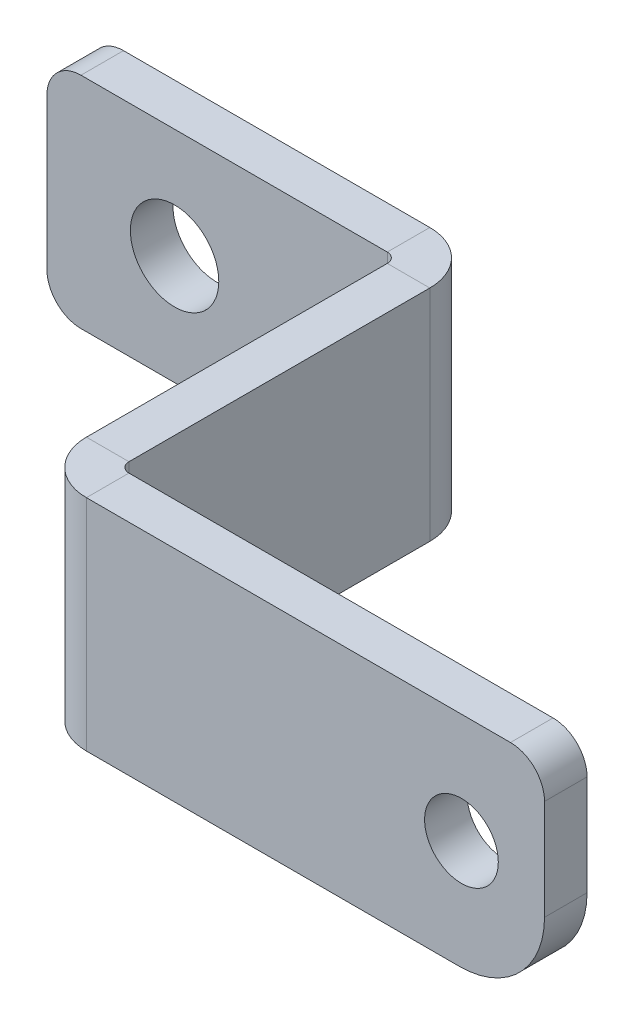
ISO-10303-21;
HEADER;
FILE_DESCRIPTION(('STEP AP214'),'2;1');
FILE_NAME('part.step','',(''),(''),'','','');
FILE_SCHEMA(('AUTOMOTIVE_DESIGN { 1 0 10303 214 1 1 1 1 }'));
ENDSEC;
DATA;
#1=APPLICATION_CONTEXT('core data for automotive mechanical design processes');
#2=APPLICATION_PROTOCOL_DEFINITION('international standard','automotive_design',2000,#1);
#3=PRODUCT_CONTEXT('',#1,'mechanical');
#4=PRODUCT('Part','Part','',(#3));
#5=PRODUCT_RELATED_PRODUCT_CATEGORY('part','',(#4));
#6=PRODUCT_DEFINITION_FORMATION('','',#4);
#7=PRODUCT_DEFINITION_CONTEXT('part definition',#1,'design');
#8=PRODUCT_DEFINITION('design','',#6,#7);
#9=PRODUCT_DEFINITION_SHAPE('','',#8);
#10=(LENGTH_UNIT() NAMED_UNIT(*) SI_UNIT(.MILLI.,.METRE.));
#11=(NAMED_UNIT(*) PLANE_ANGLE_UNIT() SI_UNIT($,.RADIAN.));
#12=(NAMED_UNIT(*) SI_UNIT($,.STERADIAN.) SOLID_ANGLE_UNIT());
#13=UNCERTAINTY_MEASURE_WITH_UNIT(LENGTH_MEASURE(1.E-05),#10,'distance_accuracy_value','');
#14=(GEOMETRIC_REPRESENTATION_CONTEXT(3) GLOBAL_UNCERTAINTY_ASSIGNED_CONTEXT((#13)) GLOBAL_UNIT_ASSIGNED_CONTEXT((#10,
#11,#12)) REPRESENTATION_CONTEXT('',''));
#15=CARTESIAN_POINT('',(0.,0.,0.));
#16=DIRECTION('',(0.,0.,1.));
#17=DIRECTION('',(1.,0.,0.));
#18=AXIS2_PLACEMENT_3D('',#15,#16,#17);
#19=CARTESIAN_POINT('',(65.8241,-45.5626000012021,0.));
#20=DIRECTION('',(0.,1.,0.));
#21=DIRECTION('',(0.,0.,1.));
#22=AXIS2_PLACEMENT_3D('',#19,#20,#21);
#23=PLANE('',#22);
#24=DIRECTION('',(-1.,0.,0.));
#25=VECTOR('',#24,1.);
#26=CARTESIAN_POINT('',(65.8241000000001,-45.5626000012021,23.1902));
#27=LINE('',#26,#25);
#28=CARTESIAN_POINT('',(65.8241000000001,-45.5626000012021,23.1902));
#29=VERTEX_POINT('',#28);
#30=CARTESIAN_POINT('',(62.6491000000001,-45.5626000012021,23.1902));
#31=VERTEX_POINT('',#30);
#32=EDGE_CURVE('E212',#29,#31,#27,.T.);
#33=ORIENTED_EDGE('',*,*,#32,.T.);
#34=DIRECTION('',(0.,0.,1.));
#35=VECTOR('',#34,1.);
#36=CARTESIAN_POINT('',(62.6491,-45.5626000012021,0.));
#37=LINE('',#36,#35);
#38=CARTESIAN_POINT('',(62.6491,-45.562600001202,0.736599999999997));
#39=VERTEX_POINT('',#38);
#40=EDGE_CURVE('E233',#31,#39,#37,.F.);
#41=ORIENTED_EDGE('',*,*,#40,.T.);
#42=DIRECTION('',(-1.,0.,0.));
#43=VECTOR('',#42,1.);
#44=CARTESIAN_POINT('',(65.8241,-45.5626000012021,0.736599999999986));
#45=LINE('',#44,#43);
#46=CARTESIAN_POINT('',(65.8241,-45.562600001202,0.736599999999986));
#47=VERTEX_POINT('',#46);
#48=EDGE_CURVE('E222',#39,#47,#45,.F.);
#49=ORIENTED_EDGE('',*,*,#48,.T.);
#50=DIRECTION('',(0.,0.,-1.));
#51=VECTOR('',#50,1.);
#52=CARTESIAN_POINT('',(65.8241,-45.5626000012021,-2.39758124619434E-13));
#53=LINE('',#52,#51);
#54=EDGE_CURVE('E228',#29,#47,#53,.T.);
#55=ORIENTED_EDGE('',*,*,#54,.F.);
#56=EDGE_LOOP('',(#33,#41,#49,#55));
#57=FACE_BOUND('',#56,.T.);
#58=ADVANCED_FACE('F58',(#57),#23,.F.);
#59=CARTESIAN_POINT('',(65.8241000000001,-29.1846000012021,23.9268));
#60=DIRECTION('',(0.,-1.,0.));
#61=DIRECTION('',(0.,0.,-1.));
#62=AXIS2_PLACEMENT_3D('',#59,#60,#61);
#63=PLANE('',#62);
#64=DIRECTION('',(-1.,0.,0.));
#65=VECTOR('',#64,1.);
#66=CARTESIAN_POINT('',(65.8241000000001,-29.1846000012021,23.1902));
#67=LINE('',#66,#65);
#68=CARTESIAN_POINT('',(65.8241000000001,-29.1846000012021,23.1902));
#69=VERTEX_POINT('',#68);
#70=CARTESIAN_POINT('',(62.6491000000001,-29.1846000012021,23.1902));
#71=VERTEX_POINT('',#70);
#72=EDGE_CURVE('E219',#69,#71,#67,.T.);
#73=ORIENTED_EDGE('',*,*,#72,.F.);
#74=DIRECTION('',(0.,0.,1.));
#75=VECTOR('',#74,1.);
#76=CARTESIAN_POINT('',(65.8241,-29.1846000012021,-2.22312897137587E-13));
#77=LINE('',#76,#75);
#78=CARTESIAN_POINT('',(65.8241,-29.1846000012021,0.736599999999986));
#79=VERTEX_POINT('',#78);
#80=EDGE_CURVE('E224',#79,#69,#77,.T.);
#81=ORIENTED_EDGE('',*,*,#80,.F.);
#82=DIRECTION('',(-1.,0.,0.));
#83=VECTOR('',#82,1.);
#84=CARTESIAN_POINT('',(62.6491,-29.1846000012021,0.736599999999997));
#85=LINE('',#84,#83);
#86=CARTESIAN_POINT('',(62.6491,-29.1846000012021,0.736599999999997));
#87=VERTEX_POINT('',#86);
#88=EDGE_CURVE('E238',#87,#79,#85,.F.);
#89=ORIENTED_EDGE('',*,*,#88,.F.);
#90=DIRECTION('',(0.,0.,-1.));
#91=VECTOR('',#90,1.);
#92=CARTESIAN_POINT('',(62.6491000000001,-29.1846000012021,23.9268));
#93=LINE('',#92,#91);
#94=EDGE_CURVE('E230',#87,#71,#93,.F.);
#95=ORIENTED_EDGE('',*,*,#94,.T.);
#96=EDGE_LOOP('',(#73,#81,#89,#95));
#97=FACE_BOUND('',#96,.T.);
#98=ADVANCED_FACE('F365',(#97),#63,.F.);
#99=CARTESIAN_POINT('',(65.8241,0.,-2.26544738483615E-13));
#100=DIRECTION('',(-1.,0.,0.));
#101=DIRECTION('',(0.,0.,1.));
#102=AXIS2_PLACEMENT_3D('',#99,#100,#101);
#103=PLANE('',#102);
#104=DIRECTION('',(0.,-1.,0.));
#105=VECTOR('',#104,1.);
#106=CARTESIAN_POINT('',(65.8241000000001,-45.5626000012021,23.1902));
#107=LINE('',#106,#105);
#108=EDGE_CURVE('E216',#29,#69,#107,.F.);
#109=ORIENTED_EDGE('',*,*,#108,.F.);
#110=ORIENTED_EDGE('',*,*,#54,.T.);
#111=DIRECTION('',(0.,1.,0.));
#112=VECTOR('',#111,1.);
#113=CARTESIAN_POINT('',(65.8241,-45.5626000012021,0.736599999999986));
#114=LINE('',#113,#112);
#115=EDGE_CURVE('E235',#79,#47,#114,.F.);
#116=ORIENTED_EDGE('',*,*,#115,.F.);
#117=ORIENTED_EDGE('',*,*,#80,.T.);
#118=EDGE_LOOP('',(#109,#110,#116,#117));
#119=FACE_BOUND('',#118,.T.);
#120=ADVANCED_FACE('F371',(#119),#103,.F.);
#121=CARTESIAN_POINT('',(62.6491,0.,-2.15459285232788E-13));
#122=DIRECTION('',(-1.,0.,0.));
#123=DIRECTION('',(0.,0.,1.));
#124=AXIS2_PLACEMENT_3D('',#121,#122,#123);
#125=PLANE('',#124);
#126=ORIENTED_EDGE('',*,*,#40,.F.);
#127=DIRECTION('',(0.,-1.,0.));
#128=VECTOR('',#127,1.);
#129=CARTESIAN_POINT('',(62.6491000000001,-45.5626000012021,23.1902));
#130=LINE('',#129,#128);
#131=EDGE_CURVE('E178',#31,#71,#130,.F.);
#132=ORIENTED_EDGE('',*,*,#131,.T.);
#133=ORIENTED_EDGE('',*,*,#94,.F.);
#134=DIRECTION('',(0.,1.,0.));
#135=VECTOR('',#134,1.);
#136=CARTESIAN_POINT('',(62.6491,-45.5626000012021,0.736599999999997));
#137=LINE('',#136,#135);
#138=EDGE_CURVE('E241',#39,#87,#137,.T.);
#139=ORIENTED_EDGE('',*,*,#138,.F.);
#140=EDGE_LOOP('',(#126,#132,#133,#139));
#141=FACE_BOUND('',#140,.T.);
#142=ADVANCED_FACE('F416',(#141),#125,.T.);
#143=CARTESIAN_POINT('',(36.5125,-29.1846000012021,-3.175));
#144=DIRECTION('',(0.,1.,0.));
#145=DIRECTION('',(0.,0.,1.));
#146=AXIS2_PLACEMENT_3D('',#143,#144,#145);
#147=PLANE('',#146);
#148=DIRECTION('',(-1.,0.,0.));
#149=VECTOR('',#148,1.);
#150=CARTESIAN_POINT('',(36.5125,-29.1846000012021,-3.175));
#151=LINE('',#150,#149);
#152=CARTESIAN_POINT('',(61.9125,-29.1846000012021,-3.175));
#153=VERTEX_POINT('',#152);
#154=CARTESIAN_POINT('',(39.0525,-29.1846000012021,-3.175));
#155=VERTEX_POINT('',#154);
#156=EDGE_CURVE('E263',#153,#155,#151,.T.);
#157=ORIENTED_EDGE('',*,*,#156,.T.);
#158=DIRECTION('',(0.,0.,1.));
#159=VECTOR('',#158,1.);
#160=CARTESIAN_POINT('',(39.0525,-29.1846000012021,-3.175));
#161=LINE('',#160,#159);
#162=CARTESIAN_POINT('',(39.0525,-29.1846000012021,0.));
#163=VERTEX_POINT('',#162);
#164=EDGE_CURVE('E310',#155,#163,#161,.T.);
#165=ORIENTED_EDGE('',*,*,#164,.T.);
#166=DIRECTION('',(-1.,0.,0.));
#167=VECTOR('',#166,1.);
#168=CARTESIAN_POINT('',(36.5125,-29.1846000012021,0.));
#169=LINE('',#168,#167);
#170=CARTESIAN_POINT('',(61.9125,-29.1846000012021,0.));
#171=VERTEX_POINT('',#170);
#172=EDGE_CURVE('E262',#171,#163,#169,.T.);
#173=ORIENTED_EDGE('',*,*,#172,.F.);
#174=DIRECTION('',(0.,0.,1.));
#175=VECTOR('',#174,1.);
#176=CARTESIAN_POINT('',(61.9125,-29.1846000012021,-3.175));
#177=LINE('',#176,#175);
#178=EDGE_CURVE('E285',#153,#171,#177,.T.);
#179=ORIENTED_EDGE('',*,*,#178,.F.);
#180=EDGE_LOOP('',(#157,#165,#173,#179));
#181=FACE_BOUND('',#180,.T.);
#182=ADVANCED_FACE('F409',(#181),#147,.T.);
#183=CARTESIAN_POINT('',(52.8905,-45.5626000012021,-3.175));
#184=DIRECTION('',(0.,-1.,0.));
#185=DIRECTION('',(1.,0.,0.));
#186=AXIS2_PLACEMENT_3D('',#183,#184,#185);
#187=PLANE('',#186);
#188=DIRECTION('',(1.,0.,0.));
#189=VECTOR('',#188,1.);
#190=CARTESIAN_POINT('',(52.8905,-45.5626000012021,0.));
#191=LINE('',#190,#189);
#192=CARTESIAN_POINT('',(39.0525,-45.5626000012021,0.));
#193=VERTEX_POINT('',#192);
#194=CARTESIAN_POINT('',(61.9125,-45.5626000012021,0.));
#195=VERTEX_POINT('',#194);
#196=EDGE_CURVE('E281',#193,#195,#191,.T.);
#197=ORIENTED_EDGE('',*,*,#196,.F.);
#198=DIRECTION('',(0.,0.,1.));
#199=VECTOR('',#198,1.);
#200=CARTESIAN_POINT('',(39.0525,-45.5626000012021,-3.175));
#201=LINE('',#200,#199);
#202=CARTESIAN_POINT('',(39.0525,-45.5626000012021,-3.175));
#203=VERTEX_POINT('',#202);
#204=EDGE_CURVE('E304',#193,#203,#201,.F.);
#205=ORIENTED_EDGE('',*,*,#204,.T.);
#206=DIRECTION('',(1.,0.,0.));
#207=VECTOR('',#206,1.);
#208=CARTESIAN_POINT('',(52.8905,-45.5626000012021,-3.175));
#209=LINE('',#208,#207);
#210=CARTESIAN_POINT('',(61.9125,-45.5626000012021,-3.175));
#211=VERTEX_POINT('',#210);
#212=EDGE_CURVE('E270',#203,#211,#209,.T.);
#213=ORIENTED_EDGE('',*,*,#212,.T.);
#214=DIRECTION('',(0.,0.,1.));
#215=VECTOR('',#214,1.);
#216=CARTESIAN_POINT('',(61.9125,-45.5626000012021,-3.175));
#217=LINE('',#216,#215);
#218=EDGE_CURVE('E275',#211,#195,#217,.T.);
#219=ORIENTED_EDGE('',*,*,#218,.T.);
#220=EDGE_LOOP('',(#197,#205,#213,#219));
#221=FACE_BOUND('',#220,.T.);
#222=ADVANCED_FACE('F406',(#221),#187,.T.);
#223=CARTESIAN_POINT('',(36.5125,-29.1846000012021,-3.175));
#224=DIRECTION('',(-1.,0.,0.));
#225=DIRECTION('',(0.,-1.,0.));
#226=AXIS2_PLACEMENT_3D('',#223,#224,#225);
#227=PLANE('',#226);
#228=DIRECTION('',(0.,-1.,0.));
#229=VECTOR('',#228,1.);
#230=CARTESIAN_POINT('',(36.5125,-29.1846000012021,-3.175));
#231=LINE('',#230,#229);
#232=CARTESIAN_POINT('',(36.5125,-31.7246000012021,-3.175));
#233=VERTEX_POINT('',#232);
#234=CARTESIAN_POINT('',(36.5125,-43.0226000012021,-3.175));
#235=VERTEX_POINT('',#234);
#236=EDGE_CURVE('E266',#233,#235,#231,.T.);
#237=ORIENTED_EDGE('',*,*,#236,.T.);
#238=DIRECTION('',(0.,0.,1.));
#239=VECTOR('',#238,1.);
#240=CARTESIAN_POINT('',(36.5125,-43.0226000012021,-3.175));
#241=LINE('',#240,#239);
#242=CARTESIAN_POINT('',(36.5125,-43.0226000012021,0.));
#243=VERTEX_POINT('',#242);
#244=EDGE_CURVE('E297',#235,#243,#241,.T.);
#245=ORIENTED_EDGE('',*,*,#244,.T.);
#246=DIRECTION('',(0.,-1.,0.));
#247=VECTOR('',#246,1.);
#248=CARTESIAN_POINT('',(36.5125,-29.1846000012021,0.));
#249=LINE('',#248,#247);
#250=CARTESIAN_POINT('',(36.5125,-31.7246000012021,0.));
#251=VERTEX_POINT('',#250);
#252=EDGE_CURVE('E278',#251,#243,#249,.T.);
#253=ORIENTED_EDGE('',*,*,#252,.F.);
#254=DIRECTION('',(0.,0.,1.));
#255=VECTOR('',#254,1.);
#256=CARTESIAN_POINT('',(36.5125,-31.7246000012021,-3.175));
#257=LINE('',#256,#255);
#258=EDGE_CURVE('E288',#251,#233,#257,.F.);
#259=ORIENTED_EDGE('',*,*,#258,.T.);
#260=EDGE_LOOP('',(#237,#245,#253,#259));
#261=FACE_BOUND('',#260,.T.);
#262=ADVANCED_FACE('F401',(#261),#227,.T.);
#263=CARTESIAN_POINT('',(0.,0.,-3.175));
#264=DIRECTION('',(0.,0.,1.));
#265=DIRECTION('',(1.,0.,0.));
#266=AXIS2_PLACEMENT_3D('',#263,#264,#265);
#267=PLANE('',#266);
#268=CARTESIAN_POINT('',(46.0375,-37.3736000012021,-3.175));
#269=DIRECTION('',(0.,0.,1.));
#270=DIRECTION('',(1.,0.,0.));
#271=AXIS2_PLACEMENT_3D('',#268,#269,#270);
#272=CIRCLE('',#271,3.3);
#273=CARTESIAN_POINT('',(49.3375,-37.3736000012021,-3.175));
#274=VERTEX_POINT('',#273);
#275=EDGE_CURVE('E259',#274,#274,#272,.T.);
#276=ORIENTED_EDGE('',*,*,#275,.T.);
#277=EDGE_LOOP('',(#276));
#278=FACE_BOUND('',#277,.T.);
#279=ORIENTED_EDGE('',*,*,#212,.F.);
#280=CARTESIAN_POINT('',(39.0525,-43.0226000012021,-3.175));
#281=DIRECTION('',(0.,0.,1.));
#282=DIRECTION('',(1.,0.,0.));
#283=AXIS2_PLACEMENT_3D('',#280,#281,#282);
#284=CIRCLE('',#283,2.54);
#285=EDGE_CURVE('E308',#203,#235,#284,.F.);
#286=ORIENTED_EDGE('',*,*,#285,.T.);
#287=ORIENTED_EDGE('',*,*,#236,.F.);
#288=CARTESIAN_POINT('',(39.0525,-31.7246000012021,-3.175));
#289=DIRECTION('',(0.,0.,1.));
#290=DIRECTION('',(1.,0.,0.));
#291=AXIS2_PLACEMENT_3D('',#288,#289,#290);
#292=CIRCLE('',#291,2.54);
#293=EDGE_CURVE('E306',#233,#155,#292,.F.);
#294=ORIENTED_EDGE('',*,*,#293,.T.);
#295=ORIENTED_EDGE('',*,*,#156,.F.);
#296=DIRECTION('',(0.,1.,0.));
#297=VECTOR('',#296,1.);
#298=CARTESIAN_POINT('',(61.9125,-45.5626000012021,-3.175));
#299=LINE('',#298,#297);
#300=EDGE_CURVE('E272',#211,#153,#299,.T.);
#301=ORIENTED_EDGE('',*,*,#300,.F.);
#302=EDGE_LOOP('',(#279,#286,#287,#294,#295,#301));
#303=FACE_BOUND('',#302,.T.);
#304=ADVANCED_FACE('F398',(#278,#303),#267,.F.);
#305=CARTESIAN_POINT('',(0.,0.,0.));
#306=DIRECTION('',(0.,0.,1.));
#307=DIRECTION('',(1.,0.,0.));
#308=AXIS2_PLACEMENT_3D('',#305,#306,#307);
#309=PLANE('',#308);
#310=CARTESIAN_POINT('',(46.0375,-37.3736000012021,0.));
#311=DIRECTION('',(0.,0.,1.));
#312=DIRECTION('',(1.,0.,0.));
#313=AXIS2_PLACEMENT_3D('',#310,#311,#312);
#314=CIRCLE('',#313,3.3);
#315=CARTESIAN_POINT('',(49.3375,-37.3736000012021,0.));
#316=VERTEX_POINT('',#315);
#317=EDGE_CURVE('E248',#316,#316,#314,.T.);
#318=ORIENTED_EDGE('',*,*,#317,.F.);
#319=EDGE_LOOP('',(#318));
#320=FACE_BOUND('',#319,.T.);
#321=ORIENTED_EDGE('',*,*,#252,.T.);
#322=CARTESIAN_POINT('',(39.0525,-43.0226000012021,0.));
#323=DIRECTION('',(0.,0.,1.));
#324=DIRECTION('',(1.,0.,0.));
#325=AXIS2_PLACEMENT_3D('',#322,#323,#324);
#326=CIRCLE('',#325,2.54);
#327=EDGE_CURVE('E302',#243,#193,#326,.T.);
#328=ORIENTED_EDGE('',*,*,#327,.T.);
#329=ORIENTED_EDGE('',*,*,#196,.T.);
#330=DIRECTION('',(0.,1.,0.));
#331=VECTOR('',#330,1.);
#332=CARTESIAN_POINT('',(61.9125,-45.5626000012021,0.));
#333=LINE('',#332,#331);
#334=EDGE_CURVE('E267',#195,#171,#333,.T.);
#335=ORIENTED_EDGE('',*,*,#334,.T.);
#336=ORIENTED_EDGE('',*,*,#172,.T.);
#337=CARTESIAN_POINT('',(39.0525,-31.7246000012021,0.));
#338=DIRECTION('',(0.,0.,1.));
#339=DIRECTION('',(1.,0.,0.));
#340=AXIS2_PLACEMENT_3D('',#337,#338,#339);
#341=CIRCLE('',#340,2.54);
#342=EDGE_CURVE('E300',#163,#251,#341,.T.);
#343=ORIENTED_EDGE('',*,*,#342,.T.);
#344=EDGE_LOOP('',(#321,#328,#329,#335,#336,#343));
#345=FACE_BOUND('',#344,.T.);
#346=ADVANCED_FACE('F396',(#320,#345),#309,.T.);
#347=CARTESIAN_POINT('',(46.0375,-37.3736000012021,0.));
#348=DIRECTION('',(0.,0.,1.));
#349=DIRECTION('',(1.,0.,0.));
#350=AXIS2_PLACEMENT_3D('',#347,#348,#349);
#351=CYLINDRICAL_SURFACE('',#350,3.3);
#352=ORIENTED_EDGE('',*,*,#275,.F.);
#353=EDGE_LOOP('',(#352));
#354=FACE_BOUND('',#353,.T.);
#355=ORIENTED_EDGE('',*,*,#317,.T.);
#356=EDGE_LOOP('',(#355));
#357=FACE_BOUND('',#356,.T.);
#358=ADVANCED_FACE('F389',(#354,#357),#351,.F.);
#359=CARTESIAN_POINT('',(61.9125,-45.562600001202,0.7366));
#360=DIRECTION('',(0.,-1.,0.));
#361=DIRECTION('',(0.,0.,-1.));
#362=AXIS2_PLACEMENT_3D('',#359,#360,#361);
#363=PLANE('',#362);
#364=ORIENTED_EDGE('',*,*,#48,.F.);
#365=CARTESIAN_POINT('',(61.9125,-45.562600001202,0.7366));
#366=DIRECTION('',(0.,1.,0.));
#367=DIRECTION('',(0.,0.,1.));
#368=AXIS2_PLACEMENT_3D('',#365,#366,#367);
#369=CIRCLE('',#368,0.736599999999997);
#370=EDGE_CURVE('E252',#195,#39,#369,.F.);
#371=ORIENTED_EDGE('',*,*,#370,.F.);
#372=ORIENTED_EDGE('',*,*,#218,.F.);
#373=CARTESIAN_POINT('',(61.9125,-45.562600001202,0.7366));
#374=DIRECTION('',(0.,1.,0.));
#375=DIRECTION('',(0.,0.,1.));
#376=AXIS2_PLACEMENT_3D('',#373,#374,#375);
#377=CIRCLE('',#376,3.9116);
#378=EDGE_CURVE('E245',#211,#47,#377,.F.);
#379=ORIENTED_EDGE('',*,*,#378,.T.);
#380=EDGE_LOOP('',(#364,#371,#372,#379));
#381=FACE_BOUND('',#380,.T.);
#382=ADVANCED_FACE('F386',(#381),#363,.T.);
#383=CARTESIAN_POINT('',(61.9125,-29.1846000012021,0.7366));
#384=DIRECTION('',(0.,-1.,0.));
#385=DIRECTION('',(0.,0.,-1.));
#386=AXIS2_PLACEMENT_3D('',#383,#384,#385);
#387=PLANE('',#386);
#388=CARTESIAN_POINT('',(61.9125,-29.1846000012021,0.7366));
#389=DIRECTION('',(0.,1.,0.));
#390=DIRECTION('',(0.,0.,1.));
#391=AXIS2_PLACEMENT_3D('',#388,#389,#390);
#392=CIRCLE('',#391,0.736599999999997);
#393=EDGE_CURVE('E227',#87,#171,#392,.T.);
#394=ORIENTED_EDGE('',*,*,#393,.F.);
#395=ORIENTED_EDGE('',*,*,#88,.T.);
#396=CARTESIAN_POINT('',(61.9125,-29.1846000012021,0.7366));
#397=DIRECTION('',(0.,1.,0.));
#398=DIRECTION('',(0.,0.,1.));
#399=AXIS2_PLACEMENT_3D('',#396,#397,#398);
#400=CIRCLE('',#399,3.9116);
#401=EDGE_CURVE('E249',#79,#153,#400,.T.);
#402=ORIENTED_EDGE('',*,*,#401,.T.);
#403=ORIENTED_EDGE('',*,*,#178,.T.);
#404=EDGE_LOOP('',(#394,#395,#402,#403));
#405=FACE_BOUND('',#404,.T.);
#406=ADVANCED_FACE('F380',(#405),#387,.F.);
#407=CARTESIAN_POINT('',(61.9125,-29.1846000012021,0.7366));
#408=DIRECTION('',(0.,1.,0.));
#409=DIRECTION('',(1.,0.,0.));
#410=AXIS2_PLACEMENT_3D('',#407,#408,#409);
#411=CYLINDRICAL_SURFACE('',#410,3.9116);
#412=ORIENTED_EDGE('',*,*,#300,.T.);
#413=ORIENTED_EDGE('',*,*,#401,.F.);
#414=ORIENTED_EDGE('',*,*,#115,.T.);
#415=ORIENTED_EDGE('',*,*,#378,.F.);
#416=EDGE_LOOP('',(#412,#413,#414,#415));
#417=FACE_BOUND('',#416,.T.);
#418=ADVANCED_FACE('F376',(#417),#411,.T.);
#419=CARTESIAN_POINT('',(61.9125,-29.1846000012021,0.7366));
#420=DIRECTION('',(0.,1.,0.));
#421=DIRECTION('',(1.,0.,0.));
#422=AXIS2_PLACEMENT_3D('',#419,#420,#421);
#423=CYLINDRICAL_SURFACE('',#422,0.736599999999997);
#424=ORIENTED_EDGE('',*,*,#334,.F.);
#425=ORIENTED_EDGE('',*,*,#370,.T.);
#426=ORIENTED_EDGE('',*,*,#138,.T.);
#427=ORIENTED_EDGE('',*,*,#393,.T.);
#428=EDGE_LOOP('',(#424,#425,#426,#427));
#429=FACE_BOUND('',#428,.T.);
#430=ADVANCED_FACE('F379',(#429),#423,.F.);
#431=CARTESIAN_POINT('',(66.5607000000001,-29.1846000012021,23.1902));
#432=DIRECTION('',(0.,1.,0.));
#433=DIRECTION('',(0.,0.,1.));
#434=AXIS2_PLACEMENT_3D('',#431,#432,#433);
#435=PLANE('',#434);
#436=DIRECTION('',(0.,0.,1.));
#437=VECTOR('',#436,1.);
#438=CARTESIAN_POINT('',(66.5607000000001,-29.1846000012021,23.9268));
#439=LINE('',#438,#437);
#440=CARTESIAN_POINT('',(66.5607000000001,-29.1846000012021,23.9268));
#441=VERTEX_POINT('',#440);
#442=CARTESIAN_POINT('',(66.5607000000001,-29.1846000012021,27.1018));
#443=VERTEX_POINT('',#442);
#444=EDGE_CURVE('E294',#441,#443,#439,.T.);
#445=ORIENTED_EDGE('',*,*,#444,.F.);
#446=CARTESIAN_POINT('',(66.5607000000001,-29.1846000012021,23.1902));
#447=DIRECTION('',(0.,-1.,0.));
#448=DIRECTION('',(0.,0.,-1.));
#449=AXIS2_PLACEMENT_3D('',#446,#447,#448);
#450=CIRCLE('',#449,0.736600000000004);
#451=EDGE_CURVE('E181',#69,#441,#450,.F.);
#452=ORIENTED_EDGE('',*,*,#451,.F.);
#453=ORIENTED_EDGE('',*,*,#72,.T.);
#454=CARTESIAN_POINT('',(66.5607000000001,-29.1846000012021,23.1902));
#455=DIRECTION('',(0.,-1.,0.));
#456=DIRECTION('',(0.,0.,-1.));
#457=AXIS2_PLACEMENT_3D('',#454,#455,#456);
#458=CIRCLE('',#457,3.9116);
#459=EDGE_CURVE('E211',#71,#443,#458,.F.);
#460=ORIENTED_EDGE('',*,*,#459,.T.);
#461=EDGE_LOOP('',(#445,#452,#453,#460));
#462=FACE_BOUND('',#461,.T.);
#463=ADVANCED_FACE('F384',(#462),#435,.T.);
#464=CARTESIAN_POINT('',(66.5607000000001,-45.5626000012021,23.1902));
#465=DIRECTION('',(0.,1.,0.));
#466=DIRECTION('',(0.,0.,1.));
#467=AXIS2_PLACEMENT_3D('',#464,#465,#466);
#468=PLANE('',#467);
#469=CARTESIAN_POINT('',(66.5607000000001,-45.5626000012021,23.1902));
#470=DIRECTION('',(0.,-1.,0.));
#471=DIRECTION('',(0.,0.,-1.));
#472=AXIS2_PLACEMENT_3D('',#469,#470,#471);
#473=CIRCLE('',#472,0.736600000000004);
#474=CARTESIAN_POINT('',(66.5607000000001,-45.5626000012021,23.9268));
#475=VERTEX_POINT('',#474);
#476=EDGE_CURVE('E188',#475,#29,#473,.T.);
#477=ORIENTED_EDGE('',*,*,#476,.F.);
#478=DIRECTION('',(0.,0.,1.));
#479=VECTOR('',#478,1.);
#480=CARTESIAN_POINT('',(66.5607000000001,-45.5626000012021,23.9268));
#481=LINE('',#480,#479);
#482=CARTESIAN_POINT('',(66.5607000000001,-45.5626000012021,27.1018));
#483=VERTEX_POINT('',#482);
#484=EDGE_CURVE('E185',#475,#483,#481,.T.);
#485=ORIENTED_EDGE('',*,*,#484,.T.);
#486=CARTESIAN_POINT('',(66.5607000000001,-45.5626000012021,23.1902));
#487=DIRECTION('',(0.,-1.,0.));
#488=DIRECTION('',(0.,0.,-1.));
#489=AXIS2_PLACEMENT_3D('',#486,#487,#488);
#490=CIRCLE('',#489,3.9116);
#491=EDGE_CURVE('E171',#483,#31,#490,.T.);
#492=ORIENTED_EDGE('',*,*,#491,.T.);
#493=ORIENTED_EDGE('',*,*,#32,.F.);
#494=EDGE_LOOP('',(#477,#485,#492,#493));
#495=FACE_BOUND('',#494,.T.);
#496=ADVANCED_FACE('F186',(#495),#468,.F.);
#497=CARTESIAN_POINT('',(66.5607000000001,-45.5626000012021,23.1902));
#498=DIRECTION('',(0.,-1.,0.));
#499=DIRECTION('',(0.,0.,1.));
#500=AXIS2_PLACEMENT_3D('',#497,#498,#499);
#501=CYLINDRICAL_SURFACE('',#500,3.9116);
#502=ORIENTED_EDGE('',*,*,#131,.F.);
#503=ORIENTED_EDGE('',*,*,#491,.F.);
#504=DIRECTION('',(0.,1.,0.));
#505=VECTOR('',#504,1.);
#506=CARTESIAN_POINT('',(66.5607000000001,0.,27.1018));
#507=LINE('',#506,#505);
#508=EDGE_CURVE('E175',#483,#443,#507,.T.);
#509=ORIENTED_EDGE('',*,*,#508,.T.);
#510=ORIENTED_EDGE('',*,*,#459,.F.);
#511=EDGE_LOOP('',(#502,#503,#509,#510));
#512=FACE_BOUND('',#511,.T.);
#513=ADVANCED_FACE('F173',(#512),#501,.T.);
#514=CARTESIAN_POINT('',(66.5607000000001,-45.5626000012021,23.1902));
#515=DIRECTION('',(0.,-1.,0.));
#516=DIRECTION('',(0.,0.,1.));
#517=AXIS2_PLACEMENT_3D('',#514,#515,#516);
#518=CYLINDRICAL_SURFACE('',#517,0.736600000000004);
#519=ORIENTED_EDGE('',*,*,#108,.T.);
#520=ORIENTED_EDGE('',*,*,#451,.T.);
#521=DIRECTION('',(0.,-1.,0.));
#522=VECTOR('',#521,1.);
#523=CARTESIAN_POINT('',(66.5607000000001,-29.1846000012021,23.9268));
#524=LINE('',#523,#522);
#525=EDGE_CURVE('E189',#441,#475,#524,.T.);
#526=ORIENTED_EDGE('',*,*,#525,.T.);
#527=ORIENTED_EDGE('',*,*,#476,.T.);
#528=EDGE_LOOP('',(#519,#520,#526,#527));
#529=FACE_BOUND('',#528,.T.);
#530=ADVANCED_FACE('F467',(#529),#518,.F.);
#531=CARTESIAN_POINT('',(65.8241000000001,-29.1846000012021,27.1018));
#532=DIRECTION('',(0.,-1.,0.));
#533=DIRECTION('',(0.,0.,-1.));
#534=AXIS2_PLACEMENT_3D('',#531,#532,#533);
#535=PLANE('',#534);
#536=DIRECTION('',(-1.,0.,0.));
#537=VECTOR('',#536,1.);
#538=CARTESIAN_POINT('',(65.8241000000001,-29.1846000012021,27.1018));
#539=LINE('',#538,#537);
#540=CARTESIAN_POINT('',(98.2091000000001,-29.1846000012021,27.1018));
#541=VERTEX_POINT('',#540);
#542=EDGE_CURVE('E196',#541,#443,#539,.T.);
#543=ORIENTED_EDGE('',*,*,#542,.F.);
#544=DIRECTION('',(0.,0.,-1.));
#545=VECTOR('',#544,1.);
#546=CARTESIAN_POINT('',(98.2091000000001,-29.1846000012021,27.1018));
#547=LINE('',#546,#545);
#548=CARTESIAN_POINT('',(98.2091000000001,-29.1846000012021,23.9268));
#549=VERTEX_POINT('',#548);
#550=EDGE_CURVE('E313',#541,#549,#547,.T.);
#551=ORIENTED_EDGE('',*,*,#550,.T.);
#552=DIRECTION('',(-1.,0.,0.));
#553=VECTOR('',#552,1.);
#554=CARTESIAN_POINT('',(65.8241000000001,-29.1846000012021,23.9268));
#555=LINE('',#554,#553);
#556=EDGE_CURVE('E197',#549,#441,#555,.T.);
#557=ORIENTED_EDGE('',*,*,#556,.T.);
#558=ORIENTED_EDGE('',*,*,#444,.T.);
#559=EDGE_LOOP('',(#543,#551,#557,#558));
#560=FACE_BOUND('',#559,.T.);
#561=ADVANCED_FACE('F342',(#560),#535,.F.);
#562=CARTESIAN_POINT('',(100.7491,-45.5626000012021,27.1018));
#563=DIRECTION('',(0.,1.,0.));
#564=DIRECTION('',(0.,0.,1.));
#565=AXIS2_PLACEMENT_3D('',#562,#563,#564);
#566=PLANE('',#565);
#567=DIRECTION('',(1.,0.,0.));
#568=VECTOR('',#567,1.);
#569=CARTESIAN_POINT('',(100.7491,-45.5626000012021,23.9268));
#570=LINE('',#569,#568);
#571=CARTESIAN_POINT('',(94.3991000000001,-45.5626000012021,23.9268));
#572=VERTEX_POINT('',#571);
#573=EDGE_CURVE('E207',#475,#572,#570,.T.);
#574=ORIENTED_EDGE('',*,*,#573,.T.);
#575=DIRECTION('',(0.,0.,-1.));
#576=VECTOR('',#575,1.);
#577=CARTESIAN_POINT('',(94.3991000000001,-45.5626000012021,27.1018));
#578=LINE('',#577,#576);
#579=CARTESIAN_POINT('',(94.3991000000001,-45.5626000012021,27.1018));
#580=VERTEX_POINT('',#579);
#581=EDGE_CURVE('E66',#572,#580,#578,.F.);
#582=ORIENTED_EDGE('',*,*,#581,.T.);
#583=DIRECTION('',(1.,0.,0.));
#584=VECTOR('',#583,1.);
#585=CARTESIAN_POINT('',(100.7491,-45.5626000012021,27.1018));
#586=LINE('',#585,#584);
#587=EDGE_CURVE('E193',#483,#580,#586,.T.);
#588=ORIENTED_EDGE('',*,*,#587,.F.);
#589=ORIENTED_EDGE('',*,*,#484,.F.);
#590=EDGE_LOOP('',(#574,#582,#588,#589));
#591=FACE_BOUND('',#590,.T.);
#592=ADVANCED_FACE('F199',(#591),#566,.F.);
#593=CARTESIAN_POINT('',(0.,0.,27.1018));
#594=DIRECTION('',(0.,0.,-1.));
#595=DIRECTION('',(-1.,0.,0.));
#596=AXIS2_PLACEMENT_3D('',#593,#594,#595);
#597=PLANE('',#596);
#598=CARTESIAN_POINT('',(94.5499000000038,-37.373600001202,27.1018));
#599=DIRECTION('',(0.,0.,1.));
#600=DIRECTION('',(1.,0.,0.));
#601=AXIS2_PLACEMENT_3D('',#598,#599,#600);
#602=CIRCLE('',#601,2.75);
#603=CARTESIAN_POINT('',(97.2999000000038,-37.373600001202,27.1018));
#604=VERTEX_POINT('',#603);
#605=EDGE_CURVE('E295',#604,#604,#602,.T.);
#606=ORIENTED_EDGE('',*,*,#605,.F.);
#607=EDGE_LOOP('',(#606));
#608=FACE_BOUND('',#607,.T.);
#609=ORIENTED_EDGE('',*,*,#587,.T.);
#610=CARTESIAN_POINT('',(94.3991000000001,-39.2126000012021,27.1018));
#611=DIRECTION('',(0.,0.,-1.));
#612=DIRECTION('',(-1.,0.,0.));
#613=AXIS2_PLACEMENT_3D('',#610,#611,#612);
#614=CIRCLE('',#613,6.35);
#615=CARTESIAN_POINT('',(100.7491,-39.2126000012021,27.1018));
#616=VERTEX_POINT('',#615);
#617=EDGE_CURVE('E13',#580,#616,#614,.F.);
#618=ORIENTED_EDGE('',*,*,#617,.T.);
#619=DIRECTION('',(0.,1.,0.));
#620=VECTOR('',#619,1.);
#621=CARTESIAN_POINT('',(100.7491,-29.1846000012021,27.1018));
#622=LINE('',#621,#620);
#623=CARTESIAN_POINT('',(100.7491,-31.7246000012021,27.1018));
#624=VERTEX_POINT('',#623);
#625=EDGE_CURVE('E200',#616,#624,#622,.T.);
#626=ORIENTED_EDGE('',*,*,#625,.T.);
#627=CARTESIAN_POINT('',(98.2091000000001,-31.7246000012021,27.1018));
#628=DIRECTION('',(0.,0.,-1.));
#629=DIRECTION('',(-1.,0.,0.));
#630=AXIS2_PLACEMENT_3D('',#627,#628,#629);
#631=CIRCLE('',#630,2.54);
#632=EDGE_CURVE('E322',#624,#541,#631,.F.);
#633=ORIENTED_EDGE('',*,*,#632,.T.);
#634=ORIENTED_EDGE('',*,*,#542,.T.);
#635=ORIENTED_EDGE('',*,*,#508,.F.);
#636=EDGE_LOOP('',(#609,#618,#626,#633,#634,#635));
#637=FACE_BOUND('',#636,.T.);
#638=ADVANCED_FACE('F192',(#608,#637),#597,.F.);
#639=CARTESIAN_POINT('',(0.,0.,23.9268));
#640=DIRECTION('',(0.,0.,-1.));
#641=DIRECTION('',(-1.,0.,0.));
#642=AXIS2_PLACEMENT_3D('',#639,#640,#641);
#643=PLANE('',#642);
#644=CARTESIAN_POINT('',(94.5499000000038,-37.373600001202,23.9268));
#645=DIRECTION('',(0.,0.,-1.));
#646=DIRECTION('',(-1.,0.,0.));
#647=AXIS2_PLACEMENT_3D('',#644,#645,#646);
#648=CIRCLE('',#647,2.75);
#649=CARTESIAN_POINT('',(91.7999000000038,-37.373600001202,23.9268));
#650=VERTEX_POINT('',#649);
#651=EDGE_CURVE('E291',#650,#650,#648,.T.);
#652=ORIENTED_EDGE('',*,*,#651,.F.);
#653=EDGE_LOOP('',(#652));
#654=FACE_BOUND('',#653,.T.);
#655=DIRECTION('',(0.,1.,0.));
#656=VECTOR('',#655,1.);
#657=CARTESIAN_POINT('',(100.7491,-29.1846000012021,23.9268));
#658=LINE('',#657,#656);
#659=CARTESIAN_POINT('',(100.7491,-39.2126000012021,23.9268));
#660=VERTEX_POINT('',#659);
#661=CARTESIAN_POINT('',(100.7491,-31.7246000012021,23.9268));
#662=VERTEX_POINT('',#661);
#663=EDGE_CURVE('E203',#660,#662,#658,.T.);
#664=ORIENTED_EDGE('',*,*,#663,.F.);
#665=CARTESIAN_POINT('',(94.3991000000001,-39.2126000012021,23.9268));
#666=DIRECTION('',(0.,0.,-1.));
#667=DIRECTION('',(-1.,0.,0.));
#668=AXIS2_PLACEMENT_3D('',#665,#666,#667);
#669=CIRCLE('',#668,6.35);
#670=EDGE_CURVE('E80',#660,#572,#669,.T.);
#671=ORIENTED_EDGE('',*,*,#670,.T.);
#672=ORIENTED_EDGE('',*,*,#573,.F.);
#673=ORIENTED_EDGE('',*,*,#525,.F.);
#674=ORIENTED_EDGE('',*,*,#556,.F.);
#675=CARTESIAN_POINT('',(98.2091000000001,-31.7246000012021,23.9268));
#676=DIRECTION('',(0.,0.,-1.));
#677=DIRECTION('',(-1.,0.,0.));
#678=AXIS2_PLACEMENT_3D('',#675,#676,#677);
#679=CIRCLE('',#678,2.54);
#680=EDGE_CURVE('E316',#549,#662,#679,.T.);
#681=ORIENTED_EDGE('',*,*,#680,.T.);
#682=EDGE_LOOP('',(#664,#671,#672,#673,#674,#681));
#683=FACE_BOUND('',#682,.T.);
#684=ADVANCED_FACE('F332',(#654,#683),#643,.T.);
#685=CARTESIAN_POINT('',(100.7491,-29.1846000012021,27.1018));
#686=DIRECTION('',(-1.,0.,0.));
#687=DIRECTION('',(0.,0.,1.));
#688=AXIS2_PLACEMENT_3D('',#685,#686,#687);
#689=PLANE('',#688);
#690=ORIENTED_EDGE('',*,*,#625,.F.);
#691=DIRECTION('',(0.,0.,-1.));
#692=VECTOR('',#691,1.);
#693=CARTESIAN_POINT('',(100.7491,-39.2126000012021,27.1018));
#694=LINE('',#693,#692);
#695=EDGE_CURVE('E324',#616,#660,#694,.T.);
#696=ORIENTED_EDGE('',*,*,#695,.T.);
#697=ORIENTED_EDGE('',*,*,#663,.T.);
#698=DIRECTION('',(0.,0.,-1.));
#699=VECTOR('',#698,1.);
#700=CARTESIAN_POINT('',(100.7491,-31.7246000012021,27.1018));
#701=LINE('',#700,#699);
#702=EDGE_CURVE('E319',#662,#624,#701,.F.);
#703=ORIENTED_EDGE('',*,*,#702,.T.);
#704=EDGE_LOOP('',(#690,#696,#697,#703));
#705=FACE_BOUND('',#704,.T.);
#706=ADVANCED_FACE('F330',(#705),#689,.F.);
#707=CARTESIAN_POINT('',(94.5499000000038,-37.373600001202,27.1018));
#708=DIRECTION('',(0.,0.,1.));
#709=DIRECTION('',(1.,0.,0.));
#710=AXIS2_PLACEMENT_3D('',#707,#708,#709);
#711=CYLINDRICAL_SURFACE('',#710,2.75);
#712=ORIENTED_EDGE('',*,*,#651,.T.);
#713=EDGE_LOOP('',(#712));
#714=FACE_BOUND('',#713,.T.);
#715=ORIENTED_EDGE('',*,*,#605,.T.);
#716=EDGE_LOOP('',(#715));
#717=FACE_BOUND('',#716,.T.);
#718=ADVANCED_FACE('F352',(#714,#717),#711,.F.);
#719=CARTESIAN_POINT('',(39.0525,-43.0226000012021,-3.175));
#720=DIRECTION('',(0.,0.,1.));
#721=DIRECTION('',(1.,0.,0.));
#722=AXIS2_PLACEMENT_3D('',#719,#720,#721);
#723=CYLINDRICAL_SURFACE('',#722,2.54);
#724=ORIENTED_EDGE('',*,*,#285,.F.);
#725=ORIENTED_EDGE('',*,*,#204,.F.);
#726=ORIENTED_EDGE('',*,*,#327,.F.);
#727=ORIENTED_EDGE('',*,*,#244,.F.);
#728=EDGE_LOOP('',(#724,#725,#726,#727));
#729=FACE_BOUND('',#728,.T.);
#730=ADVANCED_FACE('F418',(#729),#723,.T.);
#731=CARTESIAN_POINT('',(39.0525,-31.7246000012021,-3.175));
#732=DIRECTION('',(0.,0.,1.));
#733=DIRECTION('',(1.,0.,0.));
#734=AXIS2_PLACEMENT_3D('',#731,#732,#733);
#735=CYLINDRICAL_SURFACE('',#734,2.54);
#736=ORIENTED_EDGE('',*,*,#293,.F.);
#737=ORIENTED_EDGE('',*,*,#258,.F.);
#738=ORIENTED_EDGE('',*,*,#342,.F.);
#739=ORIENTED_EDGE('',*,*,#164,.F.);
#740=EDGE_LOOP('',(#736,#737,#738,#739));
#741=FACE_BOUND('',#740,.T.);
#742=ADVANCED_FACE('F421',(#741),#735,.T.);
#743=CARTESIAN_POINT('',(98.2091000000001,-31.7246000012021,27.1018));
#744=DIRECTION('',(0.,0.,-1.));
#745=DIRECTION('',(-1.,0.,0.));
#746=AXIS2_PLACEMENT_3D('',#743,#744,#745);
#747=CYLINDRICAL_SURFACE('',#746,2.54);
#748=ORIENTED_EDGE('',*,*,#632,.F.);
#749=ORIENTED_EDGE('',*,*,#702,.F.);
#750=ORIENTED_EDGE('',*,*,#680,.F.);
#751=ORIENTED_EDGE('',*,*,#550,.F.);
#752=EDGE_LOOP('',(#748,#749,#750,#751));
#753=FACE_BOUND('',#752,.T.);
#754=ADVANCED_FACE('F339',(#753),#747,.T.);
#755=CARTESIAN_POINT('',(94.3991000000001,-39.2126000012021,27.1018));
#756=DIRECTION('',(0.,0.,-1.));
#757=DIRECTION('',(-1.,0.,0.));
#758=AXIS2_PLACEMENT_3D('',#755,#756,#757);
#759=CYLINDRICAL_SURFACE('',#758,6.35);
#760=ORIENTED_EDGE('',*,*,#617,.F.);
#761=ORIENTED_EDGE('',*,*,#581,.F.);
#762=ORIENTED_EDGE('',*,*,#670,.F.);
#763=ORIENTED_EDGE('',*,*,#695,.F.);
#764=EDGE_LOOP('',(#760,#761,#762,#763));
#765=FACE_BOUND('',#764,.T.);
#766=ADVANCED_FACE('F60',(#765),#759,.T.);
#767=CLOSED_SHELL('',(#58,#98,#120,#142,#182,#222,#262,#304,#346,#358,#382,#406,#418,#430,#463,
#496,#513,#530,#561,#592,#638,#684,#706,#718,#730,#742,#754,#766));
#768=MANIFOLD_SOLID_BREP('B2',#767);
#769=ADVANCED_BREP_SHAPE_REPRESENTATION('',(#18,#768),#14);
#770=SHAPE_DEFINITION_REPRESENTATION(#9,#769);
ENDSEC;
END-ISO-10303-21;
